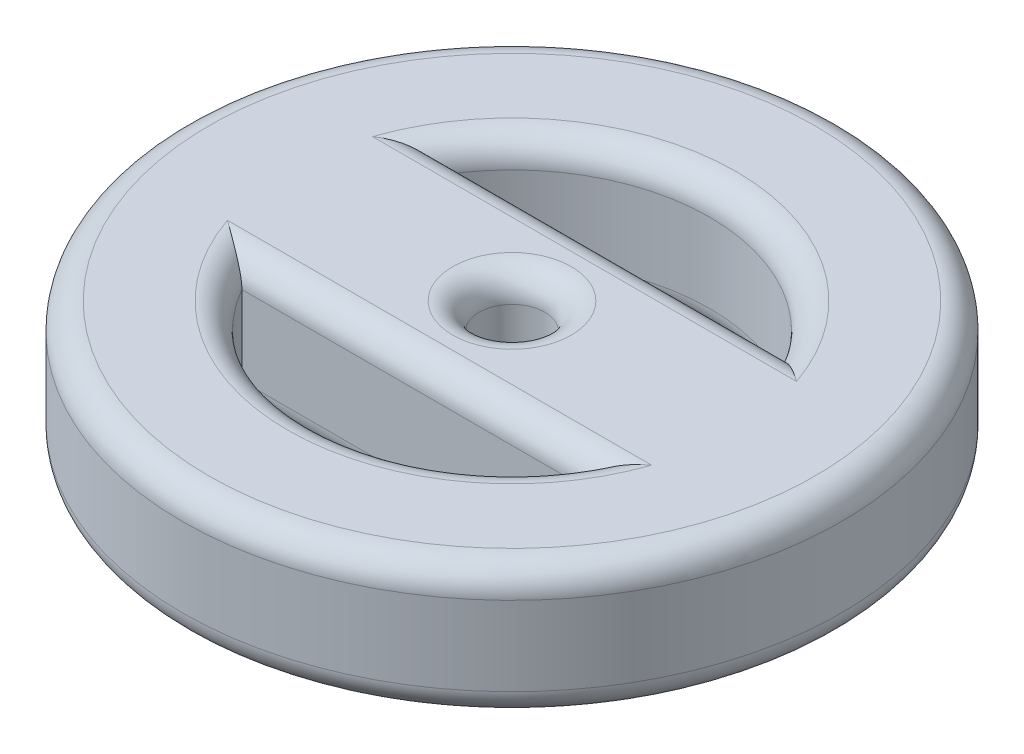
ISO-10303-21;
HEADER;
FILE_DESCRIPTION(('STEP AP214'),'2;1');
FILE_NAME('part.step','',(''),(''),'','','');
FILE_SCHEMA(('AUTOMOTIVE_DESIGN { 1 0 10303 214 1 1 1 1 }'));
ENDSEC;
DATA;
#1=APPLICATION_CONTEXT('core data for automotive mechanical design processes');
#2=APPLICATION_PROTOCOL_DEFINITION('international standard','automotive_design',2000,#1);
#3=PRODUCT_CONTEXT('',#1,'mechanical');
#4=PRODUCT('Part','Part','',(#3));
#5=PRODUCT_RELATED_PRODUCT_CATEGORY('part','',(#4));
#6=PRODUCT_DEFINITION_FORMATION('','',#4);
#7=PRODUCT_DEFINITION_CONTEXT('part definition',#1,'design');
#8=PRODUCT_DEFINITION('design','',#6,#7);
#9=PRODUCT_DEFINITION_SHAPE('','',#8);
#10=(LENGTH_UNIT() NAMED_UNIT(*) SI_UNIT(.MILLI.,.METRE.));
#11=(NAMED_UNIT(*) PLANE_ANGLE_UNIT() SI_UNIT($,.RADIAN.));
#12=(NAMED_UNIT(*) SI_UNIT($,.STERADIAN.) SOLID_ANGLE_UNIT());
#13=UNCERTAINTY_MEASURE_WITH_UNIT(LENGTH_MEASURE(1.E-05),#10,'distance_accuracy_value','');
#14=(GEOMETRIC_REPRESENTATION_CONTEXT(3) GLOBAL_UNCERTAINTY_ASSIGNED_CONTEXT((#13)) GLOBAL_UNIT_ASSIGNED_CONTEXT((#10,
#11,#12)) REPRESENTATION_CONTEXT('',''));
#15=CARTESIAN_POINT('',(0.,0.,0.));
#16=DIRECTION('',(0.,0.,1.));
#17=DIRECTION('',(1.,0.,0.));
#18=AXIS2_PLACEMENT_3D('',#15,#16,#17);
#19=CARTESIAN_POINT('',(0.,20.,0.));
#20=DIRECTION('',(0.,1.,0.));
#21=DIRECTION('',(0.,0.,1.));
#22=AXIS2_PLACEMENT_3D('',#19,#20,#21);
#23=PLANE('',#22);
#24=DIRECTION('',(1.,0.,0.));
#25=VECTOR('',#24,1.);
#26=CARTESIAN_POINT('',(0.,20.,-11.));
#27=LINE('',#26,#25);
#28=CARTESIAN_POINT('',(32.1714158842908,20.,-11.));
#29=VERTEX_POINT('',#28);
#30=CARTESIAN_POINT('',(-32.1714158842908,20.,-11.));
#31=VERTEX_POINT('',#30);
#32=EDGE_CURVE('E52',#29,#31,#27,.F.);
#33=ORIENTED_EDGE('',*,*,#32,.T.);
#34=CARTESIAN_POINT('',(0.,20.,0.));
#35=DIRECTION('',(0.,1.,0.));
#36=DIRECTION('',(0.,0.,1.));
#37=AXIS2_PLACEMENT_3D('',#34,#35,#36);
#38=CIRCLE('',#37,34.);
#39=EDGE_CURVE('E171',#31,#29,#38,.F.);
#40=ORIENTED_EDGE('',*,*,#39,.T.);
#41=EDGE_LOOP('',(#33,#40));
#42=FACE_BOUND('',#41,.T.);
#43=CARTESIAN_POINT('',(0.,20.,0.));
#44=DIRECTION('',(0.,1.,0.));
#45=DIRECTION('',(0.,0.,1.));
#46=AXIS2_PLACEMENT_3D('',#43,#44,#45);
#47=CIRCLE('',#46,9.);
#48=CARTESIAN_POINT('',(0.,20.,9.));
#49=VERTEX_POINT('',#48);
#50=EDGE_CURVE('E167',#49,#49,#47,.F.);
#51=ORIENTED_EDGE('',*,*,#50,.T.);
#52=EDGE_LOOP('',(#51));
#53=FACE_BOUND('',#52,.T.);
#54=CARTESIAN_POINT('',(0.,20.,0.));
#55=DIRECTION('',(0.,1.,0.));
#56=DIRECTION('',(0.,0.,1.));
#57=AXIS2_PLACEMENT_3D('',#54,#55,#56);
#58=CIRCLE('',#57,34.);
#59=CARTESIAN_POINT('',(32.1714158842908,20.,11.));
#60=VERTEX_POINT('',#59);
#61=CARTESIAN_POINT('',(-32.1714158842908,20.,11.));
#62=VERTEX_POINT('',#61);
#63=EDGE_CURVE('E162',#60,#62,#58,.F.);
#64=ORIENTED_EDGE('',*,*,#63,.T.);
#65=DIRECTION('',(-1.,0.,0.));
#66=VECTOR('',#65,1.);
#67=CARTESIAN_POINT('',(0.,20.,11.));
#68=LINE('',#67,#66);
#69=EDGE_CURVE('E164',#62,#60,#68,.F.);
#70=ORIENTED_EDGE('',*,*,#69,.T.);
#71=EDGE_LOOP('',(#64,#70));
#72=FACE_BOUND('',#71,.T.);
#73=CARTESIAN_POINT('',(0.,20.,0.));
#74=DIRECTION('',(0.,1.,0.));
#75=DIRECTION('',(0.,0.,1.));
#76=AXIS2_PLACEMENT_3D('',#73,#74,#75);
#77=CIRCLE('',#76,46.);
#78=CARTESIAN_POINT('',(0.,20.,46.));
#79=VERTEX_POINT('',#78);
#80=EDGE_CURVE('E159',#79,#79,#77,.T.);
#81=ORIENTED_EDGE('',*,*,#80,.T.);
#82=EDGE_LOOP('',(#81));
#83=FACE_BOUND('',#82,.T.);
#84=ADVANCED_FACE('F31',(#42,#53,#72,#83),#23,.T.);
#85=CARTESIAN_POINT('',(0.,0.,0.));
#86=DIRECTION('',(0.,1.,0.));
#87=DIRECTION('',(0.,0.,1.));
#88=AXIS2_PLACEMENT_3D('',#85,#86,#87);
#89=PLANE('',#88);
#90=CARTESIAN_POINT('',(0.,0.,0.));
#91=DIRECTION('',(0.,1.,0.));
#92=DIRECTION('',(0.,0.,1.));
#93=AXIS2_PLACEMENT_3D('',#90,#91,#92);
#94=CIRCLE('',#93,34.);
#95=CARTESIAN_POINT('',(32.1714158842908,0.,-11.));
#96=VERTEX_POINT('',#95);
#97=CARTESIAN_POINT('',(-32.1714158842908,0.,-11.));
#98=VERTEX_POINT('',#97);
#99=EDGE_CURVE('E127',#96,#98,#94,.T.);
#100=ORIENTED_EDGE('',*,*,#99,.T.);
#101=DIRECTION('',(1.,0.,0.));
#102=VECTOR('',#101,1.);
#103=CARTESIAN_POINT('',(25.9807621135332,0.,-11.));
#104=LINE('',#103,#102);
#105=EDGE_CURVE('E132',#98,#96,#104,.T.);
#106=ORIENTED_EDGE('',*,*,#105,.T.);
#107=EDGE_LOOP('',(#100,#106));
#108=FACE_BOUND('',#107,.T.);
#109=CARTESIAN_POINT('',(0.,0.,0.));
#110=DIRECTION('',(0.,1.,0.));
#111=DIRECTION('',(0.,0.,1.));
#112=AXIS2_PLACEMENT_3D('',#109,#110,#111);
#113=CIRCLE('',#112,9.);
#114=CARTESIAN_POINT('',(0.,0.,9.));
#115=VERTEX_POINT('',#114);
#116=EDGE_CURVE('E124',#115,#115,#113,.T.);
#117=ORIENTED_EDGE('',*,*,#116,.T.);
#118=EDGE_LOOP('',(#117));
#119=FACE_BOUND('',#118,.T.);
#120=DIRECTION('',(-1.,0.,0.));
#121=VECTOR('',#120,1.);
#122=CARTESIAN_POINT('',(-25.9807621135332,0.,11.));
#123=LINE('',#122,#121);
#124=CARTESIAN_POINT('',(32.1714158842908,0.,11.));
#125=VERTEX_POINT('',#124);
#126=CARTESIAN_POINT('',(-32.1714158842908,0.,11.));
#127=VERTEX_POINT('',#126);
#128=EDGE_CURVE('E117',#125,#127,#123,.T.);
#129=ORIENTED_EDGE('',*,*,#128,.T.);
#130=CARTESIAN_POINT('',(0.,0.,0.));
#131=DIRECTION('',(0.,1.,0.));
#132=DIRECTION('',(0.,0.,1.));
#133=AXIS2_PLACEMENT_3D('',#130,#131,#132);
#134=CIRCLE('',#133,34.);
#135=EDGE_CURVE('E109',#127,#125,#134,.T.);
#136=ORIENTED_EDGE('',*,*,#135,.T.);
#137=EDGE_LOOP('',(#129,#136));
#138=FACE_BOUND('',#137,.T.);
#139=CARTESIAN_POINT('',(0.,0.,0.));
#140=DIRECTION('',(0.,1.,0.));
#141=DIRECTION('',(0.,0.,1.));
#142=AXIS2_PLACEMENT_3D('',#139,#140,#141);
#143=CIRCLE('',#142,46.);
#144=CARTESIAN_POINT('',(0.,0.,46.));
#145=VERTEX_POINT('',#144);
#146=EDGE_CURVE('E120',#145,#145,#143,.F.);
#147=ORIENTED_EDGE('',*,*,#146,.T.);
#148=EDGE_LOOP('',(#147));
#149=FACE_BOUND('',#148,.T.);
#150=ADVANCED_FACE('F122',(#108,#119,#138,#149),#89,.F.);
#151=CARTESIAN_POINT('',(0.,20.,0.));
#152=DIRECTION('',(0.,-1.,0.));
#153=DIRECTION('',(0.,0.,-1.));
#154=AXIS2_PLACEMENT_3D('',#151,#152,#153);
#155=CYLINDRICAL_SURFACE('',#154,50.);
#156=CARTESIAN_POINT('',(0.,4.,0.));
#157=DIRECTION('',(0.,1.,0.));
#158=DIRECTION('',(0.,0.,1.));
#159=AXIS2_PLACEMENT_3D('',#156,#157,#158);
#160=CIRCLE('',#159,50.);
#161=CARTESIAN_POINT('',(0.,4.,50.));
#162=VERTEX_POINT('',#161);
#163=EDGE_CURVE('E11',#162,#162,#160,.T.);
#164=ORIENTED_EDGE('',*,*,#163,.T.);
#165=EDGE_LOOP('',(#164));
#166=FACE_BOUND('',#165,.T.);
#167=CARTESIAN_POINT('',(0.,16.,0.));
#168=DIRECTION('',(0.,1.,0.));
#169=DIRECTION('',(0.,0.,1.));
#170=AXIS2_PLACEMENT_3D('',#167,#168,#169);
#171=CIRCLE('',#170,50.);
#172=CARTESIAN_POINT('',(0.,16.,50.));
#173=VERTEX_POINT('',#172);
#174=EDGE_CURVE('E45',#173,#173,#171,.F.);
#175=ORIENTED_EDGE('',*,*,#174,.T.);
#176=EDGE_LOOP('',(#175));
#177=FACE_BOUND('',#176,.T.);
#178=ADVANCED_FACE('F266',(#166,#177),#155,.T.);
#179=CARTESIAN_POINT('',(0.,20.,0.));
#180=DIRECTION('',(0.,-1.,0.));
#181=DIRECTION('',(0.,0.,-1.));
#182=AXIS2_PLACEMENT_3D('',#179,#180,#181);
#183=CYLINDRICAL_SURFACE('',#182,30.);
#184=DIRECTION('',(0.,-1.,0.));
#185=VECTOR('',#184,1.);
#186=CARTESIAN_POINT('',(-25.9807621135332,20.,-15.));
#187=LINE('',#186,#185);
#188=CARTESIAN_POINT('',(-25.9807621135332,16.,-15.));
#189=VERTEX_POINT('',#188);
#190=CARTESIAN_POINT('',(-25.9807621135332,4.,-15.));
#191=VERTEX_POINT('',#190);
#192=EDGE_CURVE('E316',#189,#191,#187,.T.);
#193=ORIENTED_EDGE('',*,*,#192,.T.);
#194=CARTESIAN_POINT('',(0.,4.,0.));
#195=DIRECTION('',(0.,1.,0.));
#196=DIRECTION('',(0.,0.,1.));
#197=AXIS2_PLACEMENT_3D('',#194,#195,#196);
#198=CIRCLE('',#197,30.);
#199=CARTESIAN_POINT('',(25.9807621135332,4.,-15.));
#200=VERTEX_POINT('',#199);
#201=EDGE_CURVE('E143',#191,#200,#198,.F.);
#202=ORIENTED_EDGE('',*,*,#201,.T.);
#203=DIRECTION('',(0.,-1.,0.));
#204=VECTOR('',#203,1.);
#205=CARTESIAN_POINT('',(25.9807621135332,20.,-15.));
#206=LINE('',#205,#204);
#207=CARTESIAN_POINT('',(25.9807621135332,16.,-15.));
#208=VERTEX_POINT('',#207);
#209=EDGE_CURVE('E318',#208,#200,#206,.T.);
#210=ORIENTED_EDGE('',*,*,#209,.F.);
#211=CARTESIAN_POINT('',(0.,16.,0.));
#212=DIRECTION('',(0.,1.,0.));
#213=DIRECTION('',(0.,0.,1.));
#214=AXIS2_PLACEMENT_3D('',#211,#212,#213);
#215=CIRCLE('',#214,30.);
#216=EDGE_CURVE('E140',#208,#189,#215,.T.);
#217=ORIENTED_EDGE('',*,*,#216,.T.);
#218=EDGE_LOOP('',(#193,#202,#210,#217));
#219=FACE_BOUND('',#218,.T.);
#220=ADVANCED_FACE('F268',(#219),#183,.F.);
#221=CARTESIAN_POINT('',(-25.9807621135332,20.,-15.));
#222=DIRECTION('',(0.,0.,-1.));
#223=DIRECTION('',(-1.,0.,0.));
#224=AXIS2_PLACEMENT_3D('',#221,#222,#223);
#225=PLANE('',#224);
#226=ORIENTED_EDGE('',*,*,#209,.T.);
#227=DIRECTION('',(1.,0.,0.));
#228=VECTOR('',#227,1.);
#229=CARTESIAN_POINT('',(-25.9807621135332,4.,-15.));
#230=LINE('',#229,#228);
#231=EDGE_CURVE('E137',#200,#191,#230,.F.);
#232=ORIENTED_EDGE('',*,*,#231,.T.);
#233=ORIENTED_EDGE('',*,*,#192,.F.);
#234=DIRECTION('',(1.,0.,0.));
#235=VECTOR('',#234,1.);
#236=CARTESIAN_POINT('',(-25.9807621135332,16.,-15.));
#237=LINE('',#236,#235);
#238=EDGE_CURVE('E135',#189,#208,#237,.T.);
#239=ORIENTED_EDGE('',*,*,#238,.T.);
#240=EDGE_LOOP('',(#226,#232,#233,#239));
#241=FACE_BOUND('',#240,.T.);
#242=ADVANCED_FACE('F274',(#241),#225,.T.);
#243=CARTESIAN_POINT('',(0.,20.,0.));
#244=DIRECTION('',(0.,-1.,0.));
#245=DIRECTION('',(0.,0.,-1.));
#246=AXIS2_PLACEMENT_3D('',#243,#244,#245);
#247=CYLINDRICAL_SURFACE('',#246,30.);
#248=DIRECTION('',(0.,-1.,0.));
#249=VECTOR('',#248,1.);
#250=CARTESIAN_POINT('',(25.9807621135332,20.,15.));
#251=LINE('',#250,#249);
#252=CARTESIAN_POINT('',(25.9807621135332,16.,15.));
#253=VERTEX_POINT('',#252);
#254=CARTESIAN_POINT('',(25.9807621135332,4.,15.));
#255=VERTEX_POINT('',#254);
#256=EDGE_CURVE('E321',#253,#255,#251,.T.);
#257=ORIENTED_EDGE('',*,*,#256,.T.);
#258=CARTESIAN_POINT('',(0.,4.,0.));
#259=DIRECTION('',(0.,1.,0.));
#260=DIRECTION('',(0.,0.,1.));
#261=AXIS2_PLACEMENT_3D('',#258,#259,#260);
#262=CIRCLE('',#261,30.);
#263=CARTESIAN_POINT('',(-25.9807621135332,4.,15.));
#264=VERTEX_POINT('',#263);
#265=EDGE_CURVE('E111',#255,#264,#262,.F.);
#266=ORIENTED_EDGE('',*,*,#265,.T.);
#267=DIRECTION('',(0.,-1.,0.));
#268=VECTOR('',#267,1.);
#269=CARTESIAN_POINT('',(-25.9807621135332,20.,15.));
#270=LINE('',#269,#268);
#271=CARTESIAN_POINT('',(-25.9807621135332,16.,15.));
#272=VERTEX_POINT('',#271);
#273=EDGE_CURVE('E326',#272,#264,#270,.T.);
#274=ORIENTED_EDGE('',*,*,#273,.F.);
#275=CARTESIAN_POINT('',(0.,16.,0.));
#276=DIRECTION('',(0.,1.,0.));
#277=DIRECTION('',(0.,0.,1.));
#278=AXIS2_PLACEMENT_3D('',#275,#276,#277);
#279=CIRCLE('',#278,30.);
#280=EDGE_CURVE('E151',#272,#253,#279,.T.);
#281=ORIENTED_EDGE('',*,*,#280,.T.);
#282=EDGE_LOOP('',(#257,#266,#274,#281));
#283=FACE_BOUND('',#282,.T.);
#284=ADVANCED_FACE('F282',(#283),#247,.F.);
#285=CARTESIAN_POINT('',(-25.9807621135332,20.,15.));
#286=DIRECTION('',(0.,0.,1.));
#287=DIRECTION('',(1.,0.,0.));
#288=AXIS2_PLACEMENT_3D('',#285,#286,#287);
#289=PLANE('',#288);
#290=ORIENTED_EDGE('',*,*,#273,.T.);
#291=DIRECTION('',(-1.,0.,0.));
#292=VECTOR('',#291,1.);
#293=CARTESIAN_POINT('',(25.9807621135332,4.,15.));
#294=LINE('',#293,#292);
#295=EDGE_CURVE('E157',#264,#255,#294,.F.);
#296=ORIENTED_EDGE('',*,*,#295,.T.);
#297=ORIENTED_EDGE('',*,*,#256,.F.);
#298=DIRECTION('',(-1.,0.,0.));
#299=VECTOR('',#298,1.);
#300=CARTESIAN_POINT('',(-25.9807621135332,16.,15.));
#301=LINE('',#300,#299);
#302=EDGE_CURVE('E154',#253,#272,#301,.T.);
#303=ORIENTED_EDGE('',*,*,#302,.T.);
#304=EDGE_LOOP('',(#290,#296,#297,#303));
#305=FACE_BOUND('',#304,.T.);
#306=ADVANCED_FACE('F286',(#305),#289,.T.);
#307=CARTESIAN_POINT('',(0.,20.,0.));
#308=DIRECTION('',(0.,-1.,0.));
#309=DIRECTION('',(0.,0.,-1.));
#310=AXIS2_PLACEMENT_3D('',#307,#308,#309);
#311=CYLINDRICAL_SURFACE('',#310,5.);
#312=CARTESIAN_POINT('',(0.,4.,0.));
#313=DIRECTION('',(0.,1.,0.));
#314=DIRECTION('',(0.,0.,1.));
#315=AXIS2_PLACEMENT_3D('',#312,#313,#314);
#316=CIRCLE('',#315,5.);
#317=CARTESIAN_POINT('',(0.,4.,5.));
#318=VERTEX_POINT('',#317);
#319=EDGE_CURVE('E148',#318,#318,#316,.F.);
#320=ORIENTED_EDGE('',*,*,#319,.T.);
#321=EDGE_LOOP('',(#320));
#322=FACE_BOUND('',#321,.T.);
#323=CARTESIAN_POINT('',(0.,16.,0.));
#324=DIRECTION('',(0.,1.,0.));
#325=DIRECTION('',(0.,0.,1.));
#326=AXIS2_PLACEMENT_3D('',#323,#324,#325);
#327=CIRCLE('',#326,5.);
#328=CARTESIAN_POINT('',(0.,16.,5.));
#329=VERTEX_POINT('',#328);
#330=EDGE_CURVE('E145',#329,#329,#327,.T.);
#331=ORIENTED_EDGE('',*,*,#330,.T.);
#332=EDGE_LOOP('',(#331));
#333=FACE_BOUND('',#332,.T.);
#334=ADVANCED_FACE('F290',(#322,#333),#311,.F.);
#335=CARTESIAN_POINT('',(0.,4.,0.));
#336=DIRECTION('',(0.,1.,0.));
#337=DIRECTION('',(0.,0.,1.));
#338=AXIS2_PLACEMENT_3D('',#335,#336,#337);
#339=TOROIDAL_SURFACE('',#338,34.,4.);
#340=CARTESIAN_POINT('',(25.9807621135332,4.,-15.));
#341=CARTESIAN_POINT('',(25.9807395944584,3.93903277370915,-15.0000122242139));
#342=CARTESIAN_POINT('',(25.9831756810575,3.87808004957762,-14.9986065133035));
#343=CARTESIAN_POINT('',(25.9927902384522,3.75674095343591,-14.9930544130716));
#344=CARTESIAN_POINT('',(25.999963485265,3.69635403178952,-14.9889110427471));
#345=CARTESIAN_POINT('',(26.0187737337731,3.57720950990461,-14.978038836543));
#346=CARTESIAN_POINT('',(26.0303605349699,3.51844127905,-14.9713390760522));
#347=CARTESIAN_POINT('',(26.0577018856763,3.40221506075289,-14.9555151087901));
#348=CARTESIAN_POINT('',(26.0734577801591,3.34475750265006,-14.946390119622));
#349=CARTESIAN_POINT('',(26.1351573517683,3.14701857477127,-14.910616565718));
#350=CARTESIAN_POINT('',(26.191115491029,3.01081568440302,-14.8781079987426));
#351=CARTESIAN_POINT('',(26.3211921988826,2.75028028127416,-14.8022116722807));
#352=CARTESIAN_POINT('',(26.3953969088728,2.6260080793546,-14.7587722854009));
#353=CARTESIAN_POINT('',(26.5395780840297,2.41502342733305,-14.6739427517742));
#354=CARTESIAN_POINT('',(26.6070805615714,2.32595336182139,-14.6340917321475));
#355=CARTESIAN_POINT('',(26.748370556108,2.15494299759316,-14.5503295791524));
#356=CARTESIAN_POINT('',(26.8221618367834,2.07300702858327,-14.5064160130951));
#357=CARTESIAN_POINT('',(26.9746726394113,1.91569836820347,-14.4152539888592));
#358=CARTESIAN_POINT('',(27.0533975584551,1.84033308803181,-14.3680018710551));
#359=CARTESIAN_POINT('',(27.2146838327491,1.6957030682528,-14.2707500296858));
#360=CARTESIAN_POINT('',(27.2972466013446,1.62644060372605,-14.2207492926427));
#361=CARTESIAN_POINT('',(27.5336097760142,1.43960166530688,-14.0769272488922));
#362=CARTESIAN_POINT('',(27.6908673014576,1.32841153185856,-13.980461928179));
#363=CARTESIAN_POINT('',(28.0120603615173,1.12200929192715,-13.7816705712302));
#364=CARTESIAN_POINT('',(28.1760011124803,1.02680997513987,-13.6793399307276));
#365=CARTESIAN_POINT('',(28.5088035024674,0.850522343148302,-13.4697318797274));
#366=CARTESIAN_POINT('',(28.6776750525904,0.769465113499862,-13.3624442115203));
#367=CARTESIAN_POINT('',(29.0185252999905,0.620501902153623,-13.1439361488194));
#368=CARTESIAN_POINT('',(29.1905032441545,0.5525927784048,-13.0327167014491));
#369=CARTESIAN_POINT('',(29.5935532294914,0.408706545769654,-12.7697162085825));
#370=CARTESIAN_POINT('',(29.8254540756111,0.337424326519802,-12.6166277481264));
#371=CARTESIAN_POINT('',(30.2913565629677,0.215319720070248,-12.3054226897074));
#372=CARTESIAN_POINT('',(30.5253590662865,0.164506161249769,-12.1473039537828));
#373=CARTESIAN_POINT('',(30.9934078730288,0.0830321075315713,-11.8273700161896));
#374=CARTESIAN_POINT('',(31.2274524723972,0.0523194270979155,-11.6655655240005));
#375=CARTESIAN_POINT('',(31.6949185012336,0.0109704359585672,-11.3387413155799));
#376=CARTESIAN_POINT('',(31.9283402379825,0.000321019028768865,-11.1737237695007));
#377=CARTESIAN_POINT('',(32.1643635010993,2.38685143713863E-06,-11.0050414787031));
#378=CARTESIAN_POINT('',(32.1678898003042,3.9310356952086E-09,-11.002520870099));
#379=CARTESIAN_POINT('',(32.1714158842908,0.,-11.));
#380=B_SPLINE_CURVE_WITH_KNOTS('',3,(#340,#341,#342,#343,#344,#345,#346,#347,#348,#349,#350,
#351,#352,#353,#354,#355,#356,#357,#358,#359,#360,#361,#362,#363,#364,#365,#366,#367,#368,#369,
#370,#371,#372,#373,#374,#375,#376,#377,#378,#379),.UNSPECIFIED.,.F.,.F.,(4,2,2,2,2,2,2,2,2,2,2,
2,2,2,2,2,2,2,2,4),(0.,0.182813306756849,0.365425348975203,0.546019522770814,0.726672028459502,
1.17634225614464,1.62817755095253,1.98363985807139,2.33931641419807,2.69538908986269,
3.05159394984981,3.69675672916223,4.34243308737981,4.98951129228347,5.63643467115686,
6.49617296554268,7.35628167936001,8.21414844222375,9.0714546134467,9.08445823822366),.UNSPECIFIED.);
#381=EDGE_CURVE('E175',#200,#96,#380,.T.);
#382=ORIENTED_EDGE('',*,*,#381,.F.);
#383=ORIENTED_EDGE('',*,*,#201,.F.);
#384=CARTESIAN_POINT('',(-25.9807621135332,4.,-15.));
#385=CARTESIAN_POINT('',(-25.9807395944584,3.93903277370915,-15.0000122242139));
#386=CARTESIAN_POINT('',(-25.9831756810575,3.87808004957762,-14.9986065133035));
#387=CARTESIAN_POINT('',(-25.9927902384522,3.75674095343591,-14.9930544130716));
#388=CARTESIAN_POINT('',(-25.999963485265,3.69635403178952,-14.9889110427471));
#389=CARTESIAN_POINT('',(-26.0187737337731,3.57720950990461,-14.978038836543));
#390=CARTESIAN_POINT('',(-26.0303605349699,3.51844127905,-14.9713390760522));
#391=CARTESIAN_POINT('',(-26.0577018856763,3.40221506075289,-14.9555151087901));
#392=CARTESIAN_POINT('',(-26.0734577801591,3.34475750265006,-14.946390119622));
#393=CARTESIAN_POINT('',(-26.1351573517683,3.14701857477127,-14.910616565718));
#394=CARTESIAN_POINT('',(-26.191115491029,3.01081568440302,-14.8781079987426));
#395=CARTESIAN_POINT('',(-26.3211921988826,2.75028028127416,-14.8022116722807));
#396=CARTESIAN_POINT('',(-26.3953969088728,2.6260080793546,-14.7587722854009));
#397=CARTESIAN_POINT('',(-26.5395780840297,2.41502342733305,-14.6739427517742));
#398=CARTESIAN_POINT('',(-26.6070805615714,2.32595336182139,-14.6340917321475));
#399=CARTESIAN_POINT('',(-26.748370556108,2.15494299759316,-14.5503295791524));
#400=CARTESIAN_POINT('',(-26.8221618367834,2.07300702858327,-14.5064160130951));
#401=CARTESIAN_POINT('',(-26.9746726394113,1.91569836820347,-14.4152539888592));
#402=CARTESIAN_POINT('',(-27.0533975584551,1.84033308803181,-14.3680018710551));
#403=CARTESIAN_POINT('',(-27.2146838327491,1.6957030682528,-14.2707500296858));
#404=CARTESIAN_POINT('',(-27.2972466013446,1.62644060372605,-14.2207492926427));
#405=CARTESIAN_POINT('',(-27.5336097760142,1.43960166530688,-14.0769272488922));
#406=CARTESIAN_POINT('',(-27.6908673014576,1.32841153185856,-13.980461928179));
#407=CARTESIAN_POINT('',(-28.0120603615173,1.12200929192715,-13.7816705712302));
#408=CARTESIAN_POINT('',(-28.1760011124803,1.02680997513987,-13.6793399307276));
#409=CARTESIAN_POINT('',(-28.5088035024674,0.850522343148302,-13.4697318797274));
#410=CARTESIAN_POINT('',(-28.6776750525904,0.769465113499862,-13.3624442115203));
#411=CARTESIAN_POINT('',(-29.0185252999905,0.620501902153623,-13.1439361488194));
#412=CARTESIAN_POINT('',(-29.1905032441545,0.5525927784048,-13.0327167014491));
#413=CARTESIAN_POINT('',(-29.5935532294914,0.408706545769654,-12.7697162085825));
#414=CARTESIAN_POINT('',(-29.8254540756111,0.337424326519802,-12.6166277481264));
#415=CARTESIAN_POINT('',(-30.2913565629677,0.215319720070248,-12.3054226897074));
#416=CARTESIAN_POINT('',(-30.5253590662865,0.164506161249769,-12.1473039537828));
#417=CARTESIAN_POINT('',(-30.9934078730288,0.0830321075315713,-11.8273700161896));
#418=CARTESIAN_POINT('',(-31.2274524723972,0.0523194270979155,-11.6655655240005));
#419=CARTESIAN_POINT('',(-31.6949185012336,0.0109704359585672,-11.3387413155799));
#420=CARTESIAN_POINT('',(-31.9283402379825,0.000321019028768865,-11.1737237695007));
#421=CARTESIAN_POINT('',(-32.1643635010993,2.38685143713863E-06,-11.0050414787031));
#422=CARTESIAN_POINT('',(-32.1678898003042,3.9310356952086E-09,-11.002520870099));
#423=CARTESIAN_POINT('',(-32.1714158842908,0.,-11.));
#424=B_SPLINE_CURVE_WITH_KNOTS('',3,(#384,#385,#386,#387,#388,#389,#390,#391,#392,#393,#394,
#395,#396,#397,#398,#399,#400,#401,#402,#403,#404,#405,#406,#407,#408,#409,#410,#411,#412,#413,
#414,#415,#416,#417,#418,#419,#420,#421,#422,#423),.UNSPECIFIED.,.F.,.F.,(4,2,2,2,2,2,2,2,2,2,2,
2,2,2,2,2,2,2,2,4),(0.,0.182813306756849,0.365425348975203,0.546019522770814,0.726672028459502,
1.17634225614464,1.62817755095253,1.98363985807139,2.33931641419807,2.69538908986269,
3.05159394984981,3.69675672916223,4.34243308737981,4.98951129228347,5.63643467115686,
6.49617296554268,7.35628167936001,8.21414844222375,9.0714546134467,9.08445823822366),.UNSPECIFIED.);
#425=EDGE_CURVE('E182',#98,#191,#424,.F.);
#426=ORIENTED_EDGE('',*,*,#425,.F.);
#427=ORIENTED_EDGE('',*,*,#99,.F.);
#428=EDGE_LOOP('',(#382,#383,#426,#427));
#429=FACE_BOUND('',#428,.T.);
#430=ADVANCED_FACE('F186',(#429),#339,.T.);
#431=CARTESIAN_POINT('',(0.,4.,-11.));
#432=DIRECTION('',(-1.,0.,0.));
#433=DIRECTION('',(0.,0.,1.));
#434=AXIS2_PLACEMENT_3D('',#431,#432,#433);
#435=CYLINDRICAL_SURFACE('',#434,4.);
#436=ORIENTED_EDGE('',*,*,#425,.T.);
#437=ORIENTED_EDGE('',*,*,#231,.F.);
#438=ORIENTED_EDGE('',*,*,#381,.T.);
#439=ORIENTED_EDGE('',*,*,#105,.F.);
#440=EDGE_LOOP('',(#436,#437,#438,#439));
#441=FACE_BOUND('',#440,.T.);
#442=ADVANCED_FACE('F189',(#441),#435,.T.);
#443=CARTESIAN_POINT('',(0.,4.,0.));
#444=DIRECTION('',(0.,1.,0.));
#445=DIRECTION('',(0.,0.,1.));
#446=AXIS2_PLACEMENT_3D('',#443,#444,#445);
#447=TOROIDAL_SURFACE('',#446,9.,4.);
#448=ORIENTED_EDGE('',*,*,#319,.F.);
#449=EDGE_LOOP('',(#448));
#450=FACE_BOUND('',#449,.T.);
#451=ORIENTED_EDGE('',*,*,#116,.F.);
#452=EDGE_LOOP('',(#451));
#453=FACE_BOUND('',#452,.T.);
#454=ADVANCED_FACE('F193',(#450,#453),#447,.T.);
#455=CARTESIAN_POINT('',(0.,4.,11.));
#456=DIRECTION('',(1.,0.,0.));
#457=DIRECTION('',(0.,0.,-1.));
#458=AXIS2_PLACEMENT_3D('',#455,#456,#457);
#459=CYLINDRICAL_SURFACE('',#458,4.);
#460=CARTESIAN_POINT('',(25.9807621135332,4.,15.));
#461=CARTESIAN_POINT('',(25.9807395944584,3.93903277370915,15.0000122242139));
#462=CARTESIAN_POINT('',(25.9831756810575,3.87808004957762,14.9986065133035));
#463=CARTESIAN_POINT('',(25.9927902384522,3.75674095343591,14.9930544130716));
#464=CARTESIAN_POINT('',(25.999963485265,3.69635403178952,14.9889110427471));
#465=CARTESIAN_POINT('',(26.0187737337731,3.57720950990461,14.978038836543));
#466=CARTESIAN_POINT('',(26.0303605349699,3.51844127905,14.9713390760522));
#467=CARTESIAN_POINT('',(26.0577018856763,3.40221506075289,14.9555151087901));
#468=CARTESIAN_POINT('',(26.0734577801591,3.34475750265006,14.946390119622));
#469=CARTESIAN_POINT('',(26.1351573517683,3.14701857477127,14.910616565718));
#470=CARTESIAN_POINT('',(26.191115491029,3.01081568440302,14.8781079987426));
#471=CARTESIAN_POINT('',(26.3211921988826,2.75028028127416,14.8022116722807));
#472=CARTESIAN_POINT('',(26.3953969088728,2.6260080793546,14.7587722854009));
#473=CARTESIAN_POINT('',(26.5395780840297,2.41502342733305,14.6739427517742));
#474=CARTESIAN_POINT('',(26.6070805615714,2.32595336182139,14.6340917321475));
#475=CARTESIAN_POINT('',(26.748370556108,2.15494299759316,14.5503295791524));
#476=CARTESIAN_POINT('',(26.8221618367834,2.07300702858327,14.5064160130951));
#477=CARTESIAN_POINT('',(26.9746726394113,1.91569836820347,14.4152539888592));
#478=CARTESIAN_POINT('',(27.0533975584551,1.84033308803181,14.3680018710551));
#479=CARTESIAN_POINT('',(27.2146838327491,1.6957030682528,14.2707500296858));
#480=CARTESIAN_POINT('',(27.2972466013446,1.62644060372605,14.2207492926427));
#481=CARTESIAN_POINT('',(27.5336097760142,1.43960166530688,14.0769272488922));
#482=CARTESIAN_POINT('',(27.6908673014576,1.32841153185856,13.980461928179));
#483=CARTESIAN_POINT('',(28.0120603615173,1.12200929192715,13.7816705712302));
#484=CARTESIAN_POINT('',(28.1760011124803,1.02680997513987,13.6793399307276));
#485=CARTESIAN_POINT('',(28.5088035024674,0.850522343148302,13.4697318797274));
#486=CARTESIAN_POINT('',(28.6776750525904,0.769465113499862,13.3624442115203));
#487=CARTESIAN_POINT('',(29.0185252999905,0.620501902153623,13.1439361488194));
#488=CARTESIAN_POINT('',(29.1905032441545,0.5525927784048,13.0327167014491));
#489=CARTESIAN_POINT('',(29.5935532294914,0.408706545769654,12.7697162085825));
#490=CARTESIAN_POINT('',(29.8254540756111,0.337424326519802,12.6166277481264));
#491=CARTESIAN_POINT('',(30.2913565629677,0.215319720070248,12.3054226897074));
#492=CARTESIAN_POINT('',(30.5253590662865,0.164506161249769,12.1473039537828));
#493=CARTESIAN_POINT('',(30.9934078730288,0.0830321075315713,11.8273700161896));
#494=CARTESIAN_POINT('',(31.2274524723972,0.0523194270979155,11.6655655240005));
#495=CARTESIAN_POINT('',(31.6949185012336,0.0109704359585672,11.3387413155799));
#496=CARTESIAN_POINT('',(31.9283402379825,0.000321019028768865,11.1737237695007));
#497=CARTESIAN_POINT('',(32.1643635010993,2.38685143713863E-06,11.0050414787031));
#498=CARTESIAN_POINT('',(32.1678898003042,3.9310356952086E-09,11.002520870099));
#499=CARTESIAN_POINT('',(32.1714158842908,0.,11.));
#500=B_SPLINE_CURVE_WITH_KNOTS('',3,(#460,#461,#462,#463,#464,#465,#466,#467,#468,#469,#470,
#471,#472,#473,#474,#475,#476,#477,#478,#479,#480,#481,#482,#483,#484,#485,#486,#487,#488,#489,
#490,#491,#492,#493,#494,#495,#496,#497,#498,#499),.UNSPECIFIED.,.F.,.F.,(4,2,2,2,2,2,2,2,2,2,2,
2,2,2,2,2,2,2,2,4),(0.,0.182813306756849,0.365425348975203,0.546019522770814,0.726672028459502,
1.17634225614464,1.62817755095253,1.98363985807139,2.33931641419807,2.69538908986269,
3.05159394984981,3.69675672916223,4.34243308737981,4.98951129228347,5.63643467115686,
6.49617296554268,7.35628167936001,8.21414844222375,9.0714546134467,9.08445823822366),.UNSPECIFIED.);
#501=EDGE_CURVE('E105',#255,#125,#500,.T.);
#502=ORIENTED_EDGE('',*,*,#501,.F.);
#503=ORIENTED_EDGE('',*,*,#295,.F.);
#504=CARTESIAN_POINT('',(-25.9807621135332,4.,15.));
#505=CARTESIAN_POINT('',(-25.9807395944584,3.93903277370915,15.0000122242139));
#506=CARTESIAN_POINT('',(-25.9831756810575,3.87808004957762,14.9986065133035));
#507=CARTESIAN_POINT('',(-25.9927902384522,3.75674095343591,14.9930544130716));
#508=CARTESIAN_POINT('',(-25.999963485265,3.69635403178952,14.9889110427471));
#509=CARTESIAN_POINT('',(-26.0187737337731,3.57720950990461,14.978038836543));
#510=CARTESIAN_POINT('',(-26.0303605349699,3.51844127905,14.9713390760522));
#511=CARTESIAN_POINT('',(-26.0577018856763,3.40221506075289,14.9555151087901));
#512=CARTESIAN_POINT('',(-26.0734577801591,3.34475750265006,14.946390119622));
#513=CARTESIAN_POINT('',(-26.1351573517683,3.14701857477127,14.910616565718));
#514=CARTESIAN_POINT('',(-26.191115491029,3.01081568440302,14.8781079987426));
#515=CARTESIAN_POINT('',(-26.3211921988826,2.75028028127416,14.8022116722807));
#516=CARTESIAN_POINT('',(-26.3953969088728,2.6260080793546,14.7587722854009));
#517=CARTESIAN_POINT('',(-26.5395780840297,2.41502342733305,14.6739427517742));
#518=CARTESIAN_POINT('',(-26.6070805615714,2.32595336182139,14.6340917321475));
#519=CARTESIAN_POINT('',(-26.748370556108,2.15494299759316,14.5503295791524));
#520=CARTESIAN_POINT('',(-26.8221618367834,2.07300702858327,14.5064160130951));
#521=CARTESIAN_POINT('',(-26.9746726394113,1.91569836820347,14.4152539888592));
#522=CARTESIAN_POINT('',(-27.0533975584551,1.84033308803181,14.3680018710551));
#523=CARTESIAN_POINT('',(-27.2146838327491,1.6957030682528,14.2707500296858));
#524=CARTESIAN_POINT('',(-27.2972466013446,1.62644060372605,14.2207492926427));
#525=CARTESIAN_POINT('',(-27.5336097760142,1.43960166530688,14.0769272488922));
#526=CARTESIAN_POINT('',(-27.6908673014576,1.32841153185856,13.980461928179));
#527=CARTESIAN_POINT('',(-28.0120603615173,1.12200929192715,13.7816705712302));
#528=CARTESIAN_POINT('',(-28.1760011124803,1.02680997513987,13.6793399307276));
#529=CARTESIAN_POINT('',(-28.5088035024674,0.850522343148302,13.4697318797274));
#530=CARTESIAN_POINT('',(-28.6776750525904,0.769465113499862,13.3624442115203));
#531=CARTESIAN_POINT('',(-29.0185252999905,0.620501902153623,13.1439361488194));
#532=CARTESIAN_POINT('',(-29.1905032441545,0.5525927784048,13.0327167014491));
#533=CARTESIAN_POINT('',(-29.5935532294914,0.408706545769654,12.7697162085825));
#534=CARTESIAN_POINT('',(-29.8254540756111,0.337424326519802,12.6166277481264));
#535=CARTESIAN_POINT('',(-30.2913565629677,0.215319720070248,12.3054226897074));
#536=CARTESIAN_POINT('',(-30.5253590662865,0.164506161249769,12.1473039537828));
#537=CARTESIAN_POINT('',(-30.9934078730288,0.0830321075315713,11.8273700161896));
#538=CARTESIAN_POINT('',(-31.2274524723972,0.0523194270979155,11.6655655240005));
#539=CARTESIAN_POINT('',(-31.6949185012336,0.0109704359585672,11.3387413155799));
#540=CARTESIAN_POINT('',(-31.9283402379825,0.000321019028768865,11.1737237695007));
#541=CARTESIAN_POINT('',(-32.1643635010993,2.38685143713863E-06,11.0050414787031));
#542=CARTESIAN_POINT('',(-32.1678898003042,3.9310356952086E-09,11.002520870099));
#543=CARTESIAN_POINT('',(-32.1714158842908,0.,11.));
#544=B_SPLINE_CURVE_WITH_KNOTS('',3,(#504,#505,#506,#507,#508,#509,#510,#511,#512,#513,#514,
#515,#516,#517,#518,#519,#520,#521,#522,#523,#524,#525,#526,#527,#528,#529,#530,#531,#532,#533,
#534,#535,#536,#537,#538,#539,#540,#541,#542,#543),.UNSPECIFIED.,.F.,.F.,(4,2,2,2,2,2,2,2,2,2,2,
2,2,2,2,2,2,2,2,4),(0.,0.182813306756849,0.365425348975203,0.546019522770814,0.726672028459502,
1.17634225614464,1.62817755095253,1.98363985807139,2.33931641419807,2.69538908986269,
3.05159394984981,3.69675672916223,4.34243308737981,4.98951129228347,5.63643467115686,
6.49617296554268,7.35628167936001,8.21414844222375,9.0714546134467,9.08445823822366),.UNSPECIFIED.);
#545=EDGE_CURVE('E114',#127,#264,#544,.F.);
#546=ORIENTED_EDGE('',*,*,#545,.F.);
#547=ORIENTED_EDGE('',*,*,#128,.F.);
#548=EDGE_LOOP('',(#502,#503,#546,#547));
#549=FACE_BOUND('',#548,.T.);
#550=ADVANCED_FACE('F118',(#549),#459,.T.);
#551=CARTESIAN_POINT('',(0.,4.,0.));
#552=DIRECTION('',(0.,1.,0.));
#553=DIRECTION('',(0.,0.,1.));
#554=AXIS2_PLACEMENT_3D('',#551,#552,#553);
#555=TOROIDAL_SURFACE('',#554,34.,4.);
#556=ORIENTED_EDGE('',*,*,#545,.T.);
#557=ORIENTED_EDGE('',*,*,#265,.F.);
#558=ORIENTED_EDGE('',*,*,#501,.T.);
#559=ORIENTED_EDGE('',*,*,#135,.F.);
#560=EDGE_LOOP('',(#556,#557,#558,#559));
#561=FACE_BOUND('',#560,.T.);
#562=ADVANCED_FACE('F107',(#561),#555,.T.);
#563=CARTESIAN_POINT('',(-25.9807621135332,16.,-11.));
#564=DIRECTION('',(1.,0.,0.));
#565=DIRECTION('',(0.,0.,-1.));
#566=AXIS2_PLACEMENT_3D('',#563,#564,#565);
#567=CYLINDRICAL_SURFACE('',#566,4.);
#568=CARTESIAN_POINT('',(-25.9807621135332,16.,-15.));
#569=CARTESIAN_POINT('',(-25.9807395944584,16.0609672262909,-15.0000122242139));
#570=CARTESIAN_POINT('',(-25.9831756810575,16.1219199504224,-14.9986065133035));
#571=CARTESIAN_POINT('',(-25.9927902384522,16.2432590465641,-14.9930544130716));
#572=CARTESIAN_POINT('',(-25.999963485265,16.3036459682105,-14.9889110427471));
#573=CARTESIAN_POINT('',(-26.0187737337731,16.4227904900954,-14.978038836543));
#574=CARTESIAN_POINT('',(-26.0303605349699,16.48155872095,-14.9713390760522));
#575=CARTESIAN_POINT('',(-26.0577018856763,16.5977849392471,-14.9555151087901));
#576=CARTESIAN_POINT('',(-26.0734577801591,16.6552424973499,-14.946390119622));
#577=CARTESIAN_POINT('',(-26.1351573517683,16.8529814252287,-14.910616565718));
#578=CARTESIAN_POINT('',(-26.191115491029,16.989184315597,-14.8781079987426));
#579=CARTESIAN_POINT('',(-26.3211921988826,17.2497197187258,-14.8022116722807));
#580=CARTESIAN_POINT('',(-26.3953969088728,17.3739919206454,-14.7587722854009));
#581=CARTESIAN_POINT('',(-26.5395780840297,17.5849765726669,-14.6739427517742));
#582=CARTESIAN_POINT('',(-26.6070805615714,17.6740466381786,-14.6340917321475));
#583=CARTESIAN_POINT('',(-26.748370556108,17.8450570024068,-14.5503295791524));
#584=CARTESIAN_POINT('',(-26.8221618367834,17.9269929714167,-14.5064160130951));
#585=CARTESIAN_POINT('',(-26.9746726394113,18.0843016317965,-14.4152539888592));
#586=CARTESIAN_POINT('',(-27.0533975584551,18.1596669119682,-14.3680018710551));
#587=CARTESIAN_POINT('',(-27.2146838327491,18.3042969317472,-14.2707500296858));
#588=CARTESIAN_POINT('',(-27.2972466013446,18.3735593962739,-14.2207492926427));
#589=CARTESIAN_POINT('',(-27.5336097760142,18.5603983346931,-14.0769272488922));
#590=CARTESIAN_POINT('',(-27.6908673014576,18.6715884681414,-13.980461928179));
#591=CARTESIAN_POINT('',(-28.0120603615173,18.8779907080729,-13.7816705712302));
#592=CARTESIAN_POINT('',(-28.1760011124803,18.9731900248601,-13.6793399307276));
#593=CARTESIAN_POINT('',(-28.5088035024674,19.1494776568517,-13.4697318797274));
#594=CARTESIAN_POINT('',(-28.6776750525904,19.2305348865001,-13.3624442115203));
#595=CARTESIAN_POINT('',(-29.0185252999905,19.3794980978464,-13.1439361488194));
#596=CARTESIAN_POINT('',(-29.1905032441545,19.4474072215952,-13.0327167014491));
#597=CARTESIAN_POINT('',(-29.5935532294913,19.5912934542303,-12.7697162085825));
#598=CARTESIAN_POINT('',(-29.8254540756111,19.6625756734802,-12.6166277481264));
#599=CARTESIAN_POINT('',(-30.2913565629676,19.7846802799297,-12.3054226897074));
#600=CARTESIAN_POINT('',(-30.5253590662863,19.8354938387502,-12.1473039537827));
#601=CARTESIAN_POINT('',(-30.9934078730288,19.9169678924684,-11.8273700161898));
#602=CARTESIAN_POINT('',(-31.2274524723975,19.9476805729021,-11.6655655240011));
#603=CARTESIAN_POINT('',(-31.6949185012332,19.9890295640414,-11.3387413155794));
#604=CARTESIAN_POINT('',(-31.9283402379812,19.9996789809712,-11.1737237694988));
#605=CARTESIAN_POINT('',(-32.1643635010993,19.9999976131486,-11.005041478703));
#606=CARTESIAN_POINT('',(-32.1678898003042,19.999999996069,-11.0025208700989));
#607=CARTESIAN_POINT('',(-32.1714158842908,20.,-11.));
#608=B_SPLINE_CURVE_WITH_KNOTS('',3,(#568,#569,#570,#571,#572,#573,#574,#575,#576,#577,#578,
#579,#580,#581,#582,#583,#584,#585,#586,#587,#588,#589,#590,#591,#592,#593,#594,#595,#596,#597,
#598,#599,#600,#601,#602,#603,#604,#605,#606,#607),.UNSPECIFIED.,.F.,.F.,(4,2,2,2,2,2,2,2,2,2,2,
2,2,2,2,2,2,2,2,4),(0.,0.182813306756849,0.365425348975197,0.546019522770805,0.7266720284595,
1.17634225614464,1.62817755095253,1.98363985807138,2.33931641419807,2.69538908986268,
3.0515939498498,3.69675672916224,4.34243308737983,4.98951129228347,5.63643467115684,
6.49617296554264,7.35628167935992,8.21414844222368,9.07145461344672,9.08445823822366),.UNSPECIFIED.);
#609=EDGE_CURVE('E213',#31,#189,#608,.F.);
#610=ORIENTED_EDGE('',*,*,#609,.F.);
#611=ORIENTED_EDGE('',*,*,#32,.F.);
#612=CARTESIAN_POINT('',(25.9807621135332,16.,-15.));
#613=CARTESIAN_POINT('',(25.9807395944584,16.0609672262909,-15.0000122242139));
#614=CARTESIAN_POINT('',(25.9831756810575,16.1219199504224,-14.9986065133035));
#615=CARTESIAN_POINT('',(25.9927902384522,16.2432590465641,-14.9930544130716));
#616=CARTESIAN_POINT('',(25.999963485265,16.3036459682105,-14.9889110427471));
#617=CARTESIAN_POINT('',(26.0187737337731,16.4227904900954,-14.978038836543));
#618=CARTESIAN_POINT('',(26.0303605349699,16.48155872095,-14.9713390760522));
#619=CARTESIAN_POINT('',(26.0577018856763,16.5977849392471,-14.9555151087901));
#620=CARTESIAN_POINT('',(26.0734577801591,16.6552424973499,-14.946390119622));
#621=CARTESIAN_POINT('',(26.1351573517683,16.8529814252287,-14.910616565718));
#622=CARTESIAN_POINT('',(26.191115491029,16.989184315597,-14.8781079987426));
#623=CARTESIAN_POINT('',(26.3211921988826,17.2497197187258,-14.8022116722807));
#624=CARTESIAN_POINT('',(26.3953969088728,17.3739919206454,-14.7587722854009));
#625=CARTESIAN_POINT('',(26.5395780840297,17.5849765726669,-14.6739427517742));
#626=CARTESIAN_POINT('',(26.6070805615714,17.6740466381786,-14.6340917321475));
#627=CARTESIAN_POINT('',(26.748370556108,17.8450570024068,-14.5503295791524));
#628=CARTESIAN_POINT('',(26.8221618367834,17.9269929714167,-14.5064160130951));
#629=CARTESIAN_POINT('',(26.9746726394113,18.0843016317965,-14.4152539888592));
#630=CARTESIAN_POINT('',(27.0533975584551,18.1596669119682,-14.3680018710551));
#631=CARTESIAN_POINT('',(27.2146838327491,18.3042969317472,-14.2707500296858));
#632=CARTESIAN_POINT('',(27.2972466013446,18.3735593962739,-14.2207492926427));
#633=CARTESIAN_POINT('',(27.5336097760142,18.5603983346931,-14.0769272488922));
#634=CARTESIAN_POINT('',(27.6908673014576,18.6715884681414,-13.980461928179));
#635=CARTESIAN_POINT('',(28.0120603615173,18.8779907080729,-13.7816705712302));
#636=CARTESIAN_POINT('',(28.1760011124803,18.9731900248601,-13.6793399307276));
#637=CARTESIAN_POINT('',(28.5088035024674,19.1494776568517,-13.4697318797274));
#638=CARTESIAN_POINT('',(28.6776750525904,19.2305348865001,-13.3624442115203));
#639=CARTESIAN_POINT('',(29.0185252999905,19.3794980978464,-13.1439361488194));
#640=CARTESIAN_POINT('',(29.1905032441545,19.4474072215952,-13.0327167014491));
#641=CARTESIAN_POINT('',(29.5935532294913,19.5912934542303,-12.7697162085825));
#642=CARTESIAN_POINT('',(29.8254540756111,19.6625756734802,-12.6166277481264));
#643=CARTESIAN_POINT('',(30.2913565629676,19.7846802799297,-12.3054226897074));
#644=CARTESIAN_POINT('',(30.5253590662863,19.8354938387502,-12.1473039537827));
#645=CARTESIAN_POINT('',(30.9934078730288,19.9169678924684,-11.8273700161898));
#646=CARTESIAN_POINT('',(31.2274524723975,19.9476805729021,-11.6655655240011));
#647=CARTESIAN_POINT('',(31.6949185012332,19.9890295640414,-11.3387413155794));
#648=CARTESIAN_POINT('',(31.9283402379812,19.9996789809712,-11.1737237694988));
#649=CARTESIAN_POINT('',(32.1643635010993,19.9999976131486,-11.005041478703));
#650=CARTESIAN_POINT('',(32.1678898003042,19.999999996069,-11.0025208700989));
#651=CARTESIAN_POINT('',(32.1714158842908,20.,-11.));
#652=B_SPLINE_CURVE_WITH_KNOTS('',3,(#612,#613,#614,#615,#616,#617,#618,#619,#620,#621,#622,
#623,#624,#625,#626,#627,#628,#629,#630,#631,#632,#633,#634,#635,#636,#637,#638,#639,#640,#641,
#642,#643,#644,#645,#646,#647,#648,#649,#650,#651),.UNSPECIFIED.,.F.,.F.,(4,2,2,2,2,2,2,2,2,2,2,
2,2,2,2,2,2,2,2,4),(0.,0.182813306756849,0.365425348975197,0.546019522770805,0.7266720284595,
1.17634225614464,1.62817755095253,1.98363985807138,2.33931641419807,2.69538908986268,
3.0515939498498,3.69675672916224,4.34243308737983,4.98951129228347,5.63643467115684,
6.49617296554264,7.35628167935992,8.21414844222368,9.07145461344672,9.08445823822366),.UNSPECIFIED.);
#653=EDGE_CURVE('E59',#208,#29,#652,.T.);
#654=ORIENTED_EDGE('',*,*,#653,.F.);
#655=ORIENTED_EDGE('',*,*,#238,.F.);
#656=EDGE_LOOP('',(#610,#611,#654,#655));
#657=FACE_BOUND('',#656,.T.);
#658=ADVANCED_FACE('F224',(#657),#567,.T.);
#659=CARTESIAN_POINT('',(0.,16.,0.));
#660=DIRECTION('',(0.,1.,0.));
#661=DIRECTION('',(0.,0.,1.));
#662=AXIS2_PLACEMENT_3D('',#659,#660,#661);
#663=TOROIDAL_SURFACE('',#662,34.,4.);
#664=ORIENTED_EDGE('',*,*,#653,.T.);
#665=ORIENTED_EDGE('',*,*,#39,.F.);
#666=ORIENTED_EDGE('',*,*,#609,.T.);
#667=ORIENTED_EDGE('',*,*,#216,.F.);
#668=EDGE_LOOP('',(#664,#665,#666,#667));
#669=FACE_BOUND('',#668,.T.);
#670=ADVANCED_FACE('F222',(#669),#663,.T.);
#671=CARTESIAN_POINT('',(0.,16.,0.));
#672=DIRECTION('',(0.,1.,0.));
#673=DIRECTION('',(0.,0.,1.));
#674=AXIS2_PLACEMENT_3D('',#671,#672,#673);
#675=TOROIDAL_SURFACE('',#674,9.,4.);
#676=ORIENTED_EDGE('',*,*,#50,.F.);
#677=EDGE_LOOP('',(#676));
#678=FACE_BOUND('',#677,.T.);
#679=ORIENTED_EDGE('',*,*,#330,.F.);
#680=EDGE_LOOP('',(#679));
#681=FACE_BOUND('',#680,.T.);
#682=ADVANCED_FACE('F229',(#678,#681),#675,.T.);
#683=CARTESIAN_POINT('',(0.,16.,0.));
#684=DIRECTION('',(0.,1.,0.));
#685=DIRECTION('',(0.,0.,1.));
#686=AXIS2_PLACEMENT_3D('',#683,#684,#685);
#687=TOROIDAL_SURFACE('',#686,34.,4.);
#688=CARTESIAN_POINT('',(-25.9807621135332,16.,15.));
#689=CARTESIAN_POINT('',(-25.9807395944584,16.0609672262909,15.0000122242139));
#690=CARTESIAN_POINT('',(-25.9831756810575,16.1219199504224,14.9986065133035));
#691=CARTESIAN_POINT('',(-25.9927902384522,16.2432590465641,14.9930544130716));
#692=CARTESIAN_POINT('',(-25.999963485265,16.3036459682105,14.9889110427471));
#693=CARTESIAN_POINT('',(-26.0187737337731,16.4227904900954,14.978038836543));
#694=CARTESIAN_POINT('',(-26.0303605349699,16.48155872095,14.9713390760522));
#695=CARTESIAN_POINT('',(-26.0577018856763,16.5977849392471,14.9555151087901));
#696=CARTESIAN_POINT('',(-26.0734577801591,16.6552424973499,14.946390119622));
#697=CARTESIAN_POINT('',(-26.1351573517683,16.8529814252287,14.910616565718));
#698=CARTESIAN_POINT('',(-26.191115491029,16.989184315597,14.8781079987426));
#699=CARTESIAN_POINT('',(-26.3211921988826,17.2497197187258,14.8022116722807));
#700=CARTESIAN_POINT('',(-26.3953969088728,17.3739919206454,14.7587722854009));
#701=CARTESIAN_POINT('',(-26.5395780840297,17.5849765726669,14.6739427517742));
#702=CARTESIAN_POINT('',(-26.6070805615714,17.6740466381786,14.6340917321475));
#703=CARTESIAN_POINT('',(-26.748370556108,17.8450570024068,14.5503295791524));
#704=CARTESIAN_POINT('',(-26.8221618367834,17.9269929714167,14.5064160130951));
#705=CARTESIAN_POINT('',(-26.9746726394113,18.0843016317965,14.4152539888592));
#706=CARTESIAN_POINT('',(-27.0533975584551,18.1596669119682,14.3680018710551));
#707=CARTESIAN_POINT('',(-27.2146838327491,18.3042969317472,14.2707500296858));
#708=CARTESIAN_POINT('',(-27.2972466013446,18.3735593962739,14.2207492926427));
#709=CARTESIAN_POINT('',(-27.5336097760142,18.5603983346931,14.0769272488922));
#710=CARTESIAN_POINT('',(-27.6908673014576,18.6715884681414,13.980461928179));
#711=CARTESIAN_POINT('',(-28.0120603615173,18.8779907080729,13.7816705712302));
#712=CARTESIAN_POINT('',(-28.1760011124803,18.9731900248601,13.6793399307276));
#713=CARTESIAN_POINT('',(-28.5088035024674,19.1494776568517,13.4697318797274));
#714=CARTESIAN_POINT('',(-28.6776750525904,19.2305348865001,13.3624442115203));
#715=CARTESIAN_POINT('',(-29.0185252999905,19.3794980978464,13.1439361488194));
#716=CARTESIAN_POINT('',(-29.1905032441545,19.4474072215952,13.0327167014491));
#717=CARTESIAN_POINT('',(-29.5935532294913,19.5912934542303,12.7697162085825));
#718=CARTESIAN_POINT('',(-29.8254540756111,19.6625756734802,12.6166277481264));
#719=CARTESIAN_POINT('',(-30.2913565629676,19.7846802799297,12.3054226897074));
#720=CARTESIAN_POINT('',(-30.5253590662863,19.8354938387502,12.1473039537827));
#721=CARTESIAN_POINT('',(-30.9934078730288,19.9169678924684,11.8273700161898));
#722=CARTESIAN_POINT('',(-31.2274524723975,19.9476805729021,11.6655655240011));
#723=CARTESIAN_POINT('',(-31.6949185012332,19.9890295640414,11.3387413155794));
#724=CARTESIAN_POINT('',(-31.9283402379812,19.9996789809712,11.1737237694988));
#725=CARTESIAN_POINT('',(-32.1643635010993,19.9999976131486,11.005041478703));
#726=CARTESIAN_POINT('',(-32.1678898003042,19.999999996069,11.0025208700989));
#727=CARTESIAN_POINT('',(-32.1714158842908,20.,11.));
#728=B_SPLINE_CURVE_WITH_KNOTS('',3,(#688,#689,#690,#691,#692,#693,#694,#695,#696,#697,#698,
#699,#700,#701,#702,#703,#704,#705,#706,#707,#708,#709,#710,#711,#712,#713,#714,#715,#716,#717,
#718,#719,#720,#721,#722,#723,#724,#725,#726,#727),.UNSPECIFIED.,.F.,.F.,(4,2,2,2,2,2,2,2,2,2,2,
2,2,2,2,2,2,2,2,4),(0.,0.182813306756849,0.365425348975197,0.546019522770805,0.7266720284595,
1.17634225614464,1.62817755095253,1.98363985807138,2.33931641419807,2.69538908986268,
3.0515939498498,3.69675672916224,4.34243308737983,4.98951129228347,5.63643467115684,
6.49617296554264,7.35628167935992,8.21414844222368,9.07145461344672,9.08445823822366),.UNSPECIFIED.);
#729=EDGE_CURVE('E241',#62,#272,#728,.F.);
#730=ORIENTED_EDGE('',*,*,#729,.F.);
#731=ORIENTED_EDGE('',*,*,#63,.F.);
#732=CARTESIAN_POINT('',(25.9807621135332,16.,15.));
#733=CARTESIAN_POINT('',(25.9807395944584,16.0609672262909,15.0000122242139));
#734=CARTESIAN_POINT('',(25.9831756810575,16.1219199504224,14.9986065133035));
#735=CARTESIAN_POINT('',(25.9927902384522,16.2432590465641,14.9930544130716));
#736=CARTESIAN_POINT('',(25.999963485265,16.3036459682105,14.9889110427471));
#737=CARTESIAN_POINT('',(26.0187737337731,16.4227904900954,14.978038836543));
#738=CARTESIAN_POINT('',(26.0303605349699,16.48155872095,14.9713390760522));
#739=CARTESIAN_POINT('',(26.0577018856763,16.5977849392471,14.9555151087901));
#740=CARTESIAN_POINT('',(26.0734577801591,16.6552424973499,14.946390119622));
#741=CARTESIAN_POINT('',(26.1351573517683,16.8529814252287,14.910616565718));
#742=CARTESIAN_POINT('',(26.191115491029,16.989184315597,14.8781079987426));
#743=CARTESIAN_POINT('',(26.3211921988826,17.2497197187258,14.8022116722807));
#744=CARTESIAN_POINT('',(26.3953969088728,17.3739919206454,14.7587722854009));
#745=CARTESIAN_POINT('',(26.5395780840297,17.5849765726669,14.6739427517742));
#746=CARTESIAN_POINT('',(26.6070805615714,17.6740466381786,14.6340917321475));
#747=CARTESIAN_POINT('',(26.748370556108,17.8450570024068,14.5503295791524));
#748=CARTESIAN_POINT('',(26.8221618367834,17.9269929714167,14.5064160130951));
#749=CARTESIAN_POINT('',(26.9746726394113,18.0843016317965,14.4152539888592));
#750=CARTESIAN_POINT('',(27.0533975584551,18.1596669119682,14.3680018710551));
#751=CARTESIAN_POINT('',(27.2146838327491,18.3042969317472,14.2707500296858));
#752=CARTESIAN_POINT('',(27.2972466013446,18.3735593962739,14.2207492926427));
#753=CARTESIAN_POINT('',(27.5336097760142,18.5603983346931,14.0769272488922));
#754=CARTESIAN_POINT('',(27.6908673014576,18.6715884681414,13.980461928179));
#755=CARTESIAN_POINT('',(28.0120603615173,18.8779907080729,13.7816705712302));
#756=CARTESIAN_POINT('',(28.1760011124803,18.9731900248601,13.6793399307276));
#757=CARTESIAN_POINT('',(28.5088035024674,19.1494776568517,13.4697318797274));
#758=CARTESIAN_POINT('',(28.6776750525904,19.2305348865001,13.3624442115203));
#759=CARTESIAN_POINT('',(29.0185252999905,19.3794980978464,13.1439361488194));
#760=CARTESIAN_POINT('',(29.1905032441545,19.4474072215952,13.0327167014491));
#761=CARTESIAN_POINT('',(29.5935532294913,19.5912934542303,12.7697162085825));
#762=CARTESIAN_POINT('',(29.8254540756111,19.6625756734802,12.6166277481264));
#763=CARTESIAN_POINT('',(30.2913565629676,19.7846802799297,12.3054226897074));
#764=CARTESIAN_POINT('',(30.5253590662863,19.8354938387502,12.1473039537827));
#765=CARTESIAN_POINT('',(30.9934078730288,19.9169678924684,11.8273700161898));
#766=CARTESIAN_POINT('',(31.2274524723975,19.9476805729021,11.6655655240011));
#767=CARTESIAN_POINT('',(31.6949185012332,19.9890295640414,11.3387413155794));
#768=CARTESIAN_POINT('',(31.9283402379812,19.9996789809712,11.1737237694988));
#769=CARTESIAN_POINT('',(32.1643635010993,19.9999976131486,11.005041478703));
#770=CARTESIAN_POINT('',(32.1678898003042,19.999999996069,11.0025208700989));
#771=CARTESIAN_POINT('',(32.1714158842908,20.,11.));
#772=B_SPLINE_CURVE_WITH_KNOTS('',3,(#732,#733,#734,#735,#736,#737,#738,#739,#740,#741,#742,
#743,#744,#745,#746,#747,#748,#749,#750,#751,#752,#753,#754,#755,#756,#757,#758,#759,#760,#761,
#762,#763,#764,#765,#766,#767,#768,#769,#770,#771),.UNSPECIFIED.,.F.,.F.,(4,2,2,2,2,2,2,2,2,2,2,
2,2,2,2,2,2,2,2,4),(0.,0.182813306756849,0.365425348975197,0.546019522770805,0.7266720284595,
1.17634225614464,1.62817755095253,1.98363985807138,2.33931641419807,2.69538908986268,
3.0515939498498,3.69675672916224,4.34243308737983,4.98951129228347,5.63643467115684,
6.49617296554264,7.35628167935992,8.21414844222368,9.07145461344672,9.08445823822366),.UNSPECIFIED.);
#773=EDGE_CURVE('E35',#253,#60,#772,.T.);
#774=ORIENTED_EDGE('',*,*,#773,.F.);
#775=ORIENTED_EDGE('',*,*,#280,.F.);
#776=EDGE_LOOP('',(#730,#731,#774,#775));
#777=FACE_BOUND('',#776,.T.);
#778=ADVANCED_FACE('F232',(#777),#687,.T.);
#779=CARTESIAN_POINT('',(-25.9807621135332,16.,11.));
#780=DIRECTION('',(-1.,0.,0.));
#781=DIRECTION('',(0.,0.,1.));
#782=AXIS2_PLACEMENT_3D('',#779,#780,#781);
#783=CYLINDRICAL_SURFACE('',#782,4.);
#784=ORIENTED_EDGE('',*,*,#773,.T.);
#785=ORIENTED_EDGE('',*,*,#69,.F.);
#786=ORIENTED_EDGE('',*,*,#729,.T.);
#787=ORIENTED_EDGE('',*,*,#302,.F.);
#788=EDGE_LOOP('',(#784,#785,#786,#787));
#789=FACE_BOUND('',#788,.T.);
#790=ADVANCED_FACE('F234',(#789),#783,.T.);
#791=CARTESIAN_POINT('',(0.,4.,0.));
#792=DIRECTION('',(0.,1.,0.));
#793=DIRECTION('',(0.,0.,1.));
#794=AXIS2_PLACEMENT_3D('',#791,#792,#793);
#795=TOROIDAL_SURFACE('',#794,46.,4.);
#796=ORIENTED_EDGE('',*,*,#146,.F.);
#797=EDGE_LOOP('',(#796));
#798=FACE_BOUND('',#797,.T.);
#799=ORIENTED_EDGE('',*,*,#163,.F.);
#800=EDGE_LOOP('',(#799));
#801=FACE_BOUND('',#800,.T.);
#802=ADVANCED_FACE('F237',(#798,#801),#795,.T.);
#803=CARTESIAN_POINT('',(0.,16.,0.));
#804=DIRECTION('',(0.,1.,0.));
#805=DIRECTION('',(0.,0.,1.));
#806=AXIS2_PLACEMENT_3D('',#803,#804,#805);
#807=TOROIDAL_SURFACE('',#806,46.,4.);
#808=ORIENTED_EDGE('',*,*,#174,.F.);
#809=EDGE_LOOP('',(#808));
#810=FACE_BOUND('',#809,.T.);
#811=ORIENTED_EDGE('',*,*,#80,.F.);
#812=EDGE_LOOP('',(#811));
#813=FACE_BOUND('',#812,.T.);
#814=ADVANCED_FACE('F33',(#810,#813),#807,.T.);
#815=CLOSED_SHELL('',(#84,#150,#178,#220,#242,#284,#306,#334,#430,#442,#454,#550,#562,#658,#670,
#682,#778,#790,#802,#814));
#816=MANIFOLD_SOLID_BREP('B2',#815);
#817=ADVANCED_BREP_SHAPE_REPRESENTATION('',(#18,#816),#14);
#818=SHAPE_DEFINITION_REPRESENTATION(#9,#817);
ENDSEC;
END-ISO-10303-21;
